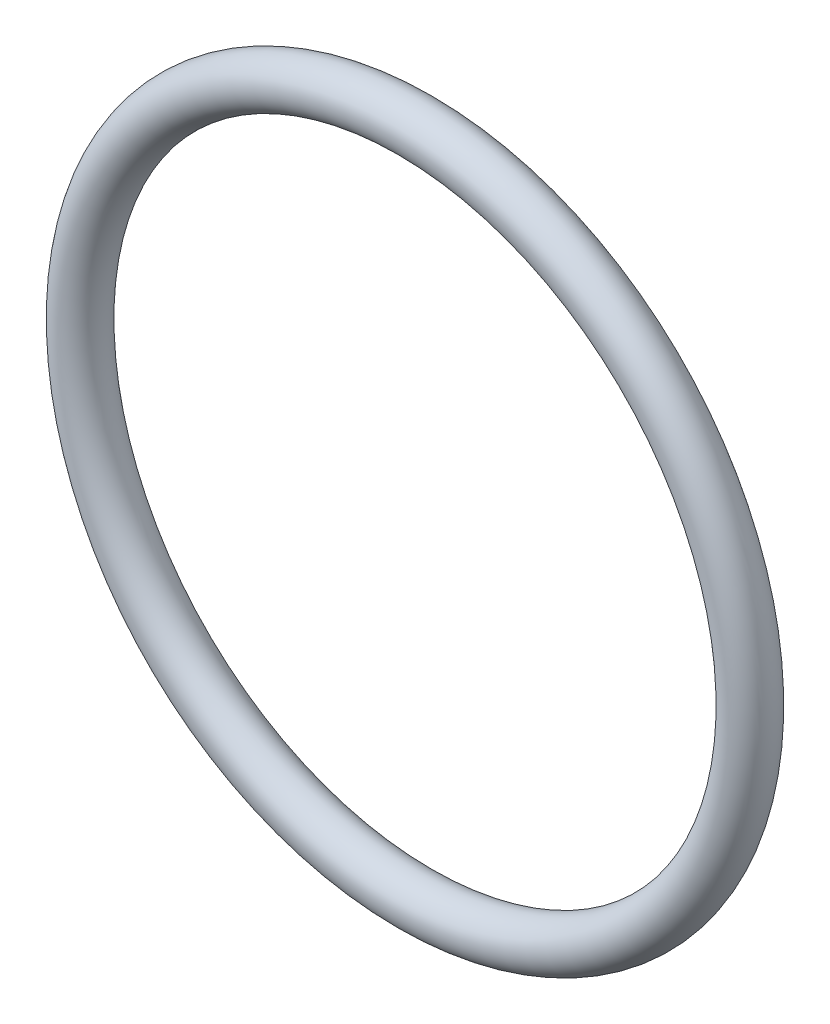
ISO-10303-21;
HEADER;
FILE_DESCRIPTION(('STEP AP214'),'2;1');
FILE_NAME('part.step','',(''),(''),'','','');
FILE_SCHEMA(('AUTOMOTIVE_DESIGN { 1 0 10303 214 1 1 1 1 }'));
ENDSEC;
DATA;
#1=APPLICATION_CONTEXT('core data for automotive mechanical design processes');
#2=APPLICATION_PROTOCOL_DEFINITION('international standard','automotive_design',2000,#1);
#3=PRODUCT_CONTEXT('',#1,'mechanical');
#4=PRODUCT('Part','Part','',(#3));
#5=PRODUCT_RELATED_PRODUCT_CATEGORY('part','',(#4));
#6=PRODUCT_DEFINITION_FORMATION('','',#4);
#7=PRODUCT_DEFINITION_CONTEXT('part definition',#1,'design');
#8=PRODUCT_DEFINITION('design','',#6,#7);
#9=PRODUCT_DEFINITION_SHAPE('','',#8);
#10=(LENGTH_UNIT() NAMED_UNIT(*) SI_UNIT(.MILLI.,.METRE.));
#11=(NAMED_UNIT(*) PLANE_ANGLE_UNIT() SI_UNIT($,.RADIAN.));
#12=(NAMED_UNIT(*) SI_UNIT($,.STERADIAN.) SOLID_ANGLE_UNIT());
#13=UNCERTAINTY_MEASURE_WITH_UNIT(LENGTH_MEASURE(1.E-05),#10,'distance_accuracy_value','');
#14=(GEOMETRIC_REPRESENTATION_CONTEXT(3) GLOBAL_UNCERTAINTY_ASSIGNED_CONTEXT((#13)) GLOBAL_UNIT_ASSIGNED_CONTEXT((#10,
#11,#12)) REPRESENTATION_CONTEXT('',''));
#15=CARTESIAN_POINT('',(0.,0.,0.));
#16=DIRECTION('',(0.,0.,1.));
#17=DIRECTION('',(1.,0.,0.));
#18=AXIS2_PLACEMENT_3D('',#15,#16,#17);
#19=CARTESIAN_POINT('',(0.,0.,0.));
#20=DIRECTION('',(0.,0.,1.));
#21=DIRECTION('',(1.,0.,0.));
#22=AXIS2_PLACEMENT_3D('',#19,#20,#21);
#23=TOROIDAL_SURFACE('',#22,28.,2.);
#24=CARTESIAN_POINT('',(0.,28.,0.));
#25=DIRECTION('',(1.,0.,0.));
#26=DIRECTION('',(0.,0.,-1.));
#27=AXIS2_PLACEMENT_3D('',#24,#25,#26);
#28=CIRCLE('',#27,2.);
#29=CARTESIAN_POINT('',(0.,30.,0.));
#30=VERTEX_POINT('',#29);
#31=EDGE_CURVE('E10',#30,#30,#28,.T.);
#32=CARTESIAN_POINT('',(0.,0.,0.));
#33=DIRECTION('',(0.,0.,1.));
#34=DIRECTION('',(1.,0.,0.));
#35=AXIS2_PLACEMENT_3D('',#32,#33,#34);
#36=CIRCLE('',#35,30.);
#37=EDGE_CURVE('',#30,#30,#36,.T.);
#38=ORIENTED_EDGE('',*,*,#31,.F.);
#39=ORIENTED_EDGE('',*,*,#31,.T.);
#40=ORIENTED_EDGE('',*,*,#37,.T.);
#41=ORIENTED_EDGE('',*,*,#37,.F.);
#42=EDGE_LOOP('',(#38,#40,#39,#41));
#43=FACE_BOUND('',#42,.T.);
#44=ADVANCED_FACE('F32',(#43),#23,.T.);
#45=CLOSED_SHELL('',(#44));
#46=MANIFOLD_SOLID_BREP('B2',#45);
#47=ADVANCED_BREP_SHAPE_REPRESENTATION('',(#18,#46),#14);
#48=SHAPE_DEFINITION_REPRESENTATION(#9,#47);
ENDSEC;
END-ISO-10303-21;
